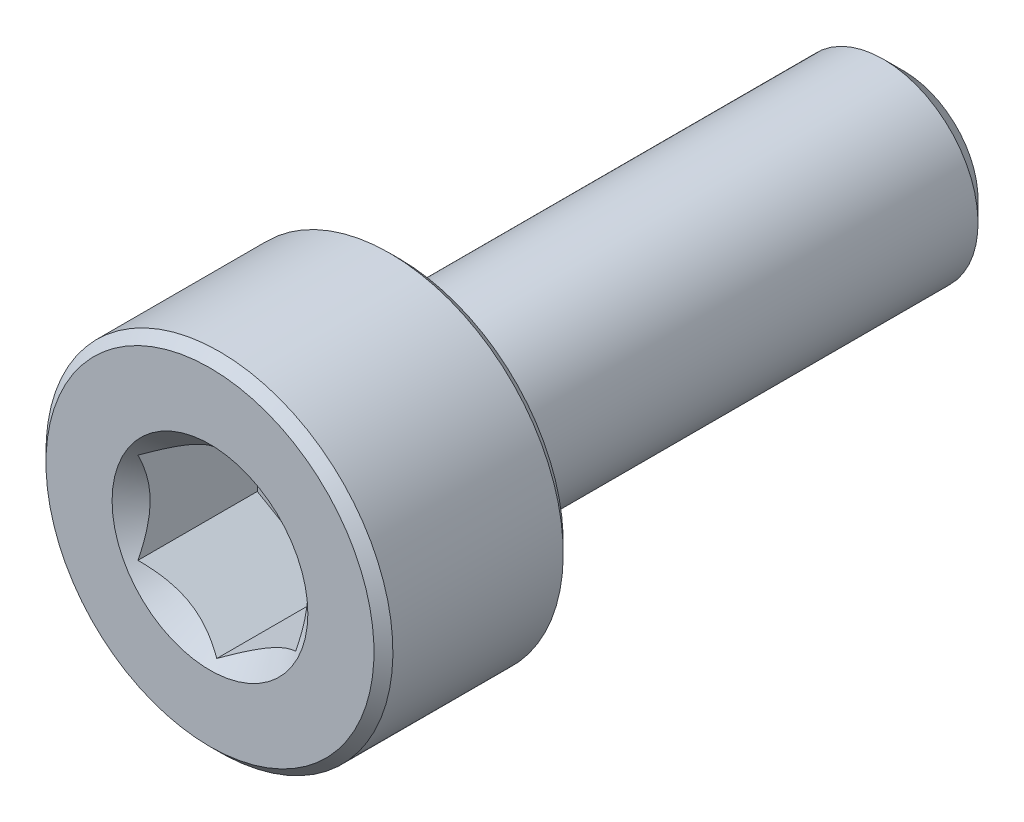
ISO-10303-21;
HEADER;
FILE_DESCRIPTION(('STEP AP214'),'2;1');
FILE_NAME('part.step','',(''),(''),'','','');
FILE_SCHEMA(('AUTOMOTIVE_DESIGN { 1 0 10303 214 1 1 1 1 }'));
ENDSEC;
DATA;
#1=APPLICATION_CONTEXT('core data for automotive mechanical design processes');
#2=APPLICATION_PROTOCOL_DEFINITION('international standard','automotive_design',2000,#1);
#3=PRODUCT_CONTEXT('',#1,'mechanical');
#4=PRODUCT('Part','Part','',(#3));
#5=PRODUCT_RELATED_PRODUCT_CATEGORY('part','',(#4));
#6=PRODUCT_DEFINITION_FORMATION('','',#4);
#7=PRODUCT_DEFINITION_CONTEXT('part definition',#1,'design');
#8=PRODUCT_DEFINITION('design','',#6,#7);
#9=PRODUCT_DEFINITION_SHAPE('','',#8);
#10=(LENGTH_UNIT() NAMED_UNIT(*) SI_UNIT(.MILLI.,.METRE.));
#11=(NAMED_UNIT(*) PLANE_ANGLE_UNIT() SI_UNIT($,.RADIAN.));
#12=(NAMED_UNIT(*) SI_UNIT($,.STERADIAN.) SOLID_ANGLE_UNIT());
#13=UNCERTAINTY_MEASURE_WITH_UNIT(LENGTH_MEASURE(1.E-05),#10,'distance_accuracy_value','');
#14=(GEOMETRIC_REPRESENTATION_CONTEXT(3) GLOBAL_UNCERTAINTY_ASSIGNED_CONTEXT((#13)) GLOBAL_UNIT_ASSIGNED_CONTEXT((#10,
#11,#12)) REPRESENTATION_CONTEXT('',''));
#15=CARTESIAN_POINT('',(0.,0.,0.));
#16=DIRECTION('',(0.,0.,1.));
#17=DIRECTION('',(1.,0.,0.));
#18=AXIS2_PLACEMENT_3D('',#15,#16,#17);
#19=CARTESIAN_POINT('',(0.,1.17524047358083,-5.5));
#20=DIRECTION('',(0.,0.,-1.));
#21=DIRECTION('',(0.,1.,0.));
#22=AXIS2_PLACEMENT_3D('',#19,#20,#21);
#23=PLANE('',#22);
#24=CARTESIAN_POINT('',(0.,0.,-5.5));
#25=DIRECTION('',(0.,0.,-1.));
#26=DIRECTION('',(0.,1.,0.));
#27=AXIS2_PLACEMENT_3D('',#24,#25,#26);
#28=CIRCLE('',#27,1.17524047358083);
#29=CARTESIAN_POINT('',(0.,1.17524047358083,-5.5));
#30=VERTEX_POINT('',#29);
#31=EDGE_CURVE('E60',#30,#30,#28,.T.);
#32=ORIENTED_EDGE('',*,*,#31,.T.);
#33=EDGE_LOOP('',(#32));
#34=FACE_BOUND('',#33,.T.);
#35=ADVANCED_FACE('F47',(#34),#23,.T.);
#36=CARTESIAN_POINT('',(0.,0.,-5.5));
#37=DIRECTION('',(0.,0.,1.));
#38=DIRECTION('',(0.,-1.,0.));
#39=AXIS2_PLACEMENT_3D('',#36,#37,#38);
#40=CONICAL_SURFACE('',#39,1.17524047358083,0.785398163397448);
#41=CARTESIAN_POINT('',(0.,0.,-5.17524047358082));
#42=DIRECTION('',(0.,0.,-1.));
#43=DIRECTION('',(0.,1.,0.));
#44=AXIS2_PLACEMENT_3D('',#41,#42,#43);
#45=CIRCLE('',#44,1.5);
#46=CARTESIAN_POINT('',(0.,1.5,-5.17524047358082));
#47=VERTEX_POINT('',#46);
#48=EDGE_CURVE('E163',#47,#47,#45,.T.);
#49=ORIENTED_EDGE('',*,*,#48,.T.);
#50=EDGE_LOOP('',(#49));
#51=FACE_BOUND('',#50,.T.);
#52=ORIENTED_EDGE('',*,*,#31,.F.);
#53=EDGE_LOOP('',(#52));
#54=FACE_BOUND('',#53,.T.);
#55=ADVANCED_FACE('F169',(#51,#54),#40,.T.);
#56=CARTESIAN_POINT('',(0.,0.,-5.5));
#57=DIRECTION('',(0.,0.,-1.));
#58=DIRECTION('',(0.,1.,0.));
#59=AXIS2_PLACEMENT_3D('',#56,#57,#58);
#60=CYLINDRICAL_SURFACE('',#59,1.5);
#61=CARTESIAN_POINT('',(0.,0.,2.35));
#62=DIRECTION('',(0.,0.,-1.));
#63=DIRECTION('',(0.,1.,0.));
#64=AXIS2_PLACEMENT_3D('',#61,#62,#63);
#65=CIRCLE('',#64,1.5);
#66=CARTESIAN_POINT('',(0.,1.5,2.35));
#67=VERTEX_POINT('',#66);
#68=EDGE_CURVE('E160',#67,#67,#65,.T.);
#69=ORIENTED_EDGE('',*,*,#68,.T.);
#70=EDGE_LOOP('',(#69));
#71=FACE_BOUND('',#70,.T.);
#72=ORIENTED_EDGE('',*,*,#48,.F.);
#73=EDGE_LOOP('',(#72));
#74=FACE_BOUND('',#73,.T.);
#75=ADVANCED_FACE('F171',(#71,#74),#60,.T.);
#76=CARTESIAN_POINT('',(0.,0.,2.35));
#77=DIRECTION('',(0.,0.,-1.));
#78=DIRECTION('',(0.,1.,0.));
#79=AXIS2_PLACEMENT_3D('',#76,#77,#78);
#80=TOROIDAL_SURFACE('',#79,1.65000000000001,0.15);
#81=CARTESIAN_POINT('',(0.,0.,2.5));
#82=DIRECTION('',(0.,0.,-1.));
#83=DIRECTION('',(0.,1.,0.));
#84=AXIS2_PLACEMENT_3D('',#81,#82,#83);
#85=CIRCLE('',#84,1.65000000000001);
#86=CARTESIAN_POINT('',(0.,1.65000000000001,2.5));
#87=VERTEX_POINT('',#86);
#88=EDGE_CURVE('E157',#87,#87,#85,.T.);
#89=ORIENTED_EDGE('',*,*,#88,.T.);
#90=EDGE_LOOP('',(#89));
#91=FACE_BOUND('',#90,.T.);
#92=ORIENTED_EDGE('',*,*,#68,.F.);
#93=EDGE_LOOP('',(#92));
#94=FACE_BOUND('',#93,.T.);
#95=ADVANCED_FACE('F177',(#91,#94),#80,.F.);
#96=CARTESIAN_POINT('',(0.,2.6,2.5));
#97=DIRECTION('',(0.,0.,-1.));
#98=DIRECTION('',(0.,1.,0.));
#99=AXIS2_PLACEMENT_3D('',#96,#97,#98);
#100=PLANE('',#99);
#101=CARTESIAN_POINT('',(0.,0.,2.5));
#102=DIRECTION('',(0.,0.,-1.));
#103=DIRECTION('',(0.,1.,0.));
#104=AXIS2_PLACEMENT_3D('',#101,#102,#103);
#105=CIRCLE('',#104,2.6);
#106=CARTESIAN_POINT('',(0.,2.6,2.5));
#107=VERTEX_POINT('',#106);
#108=EDGE_CURVE('E154',#107,#107,#105,.T.);
#109=ORIENTED_EDGE('',*,*,#108,.T.);
#110=EDGE_LOOP('',(#109));
#111=FACE_BOUND('',#110,.T.);
#112=ORIENTED_EDGE('',*,*,#88,.F.);
#113=EDGE_LOOP('',(#112));
#114=FACE_BOUND('',#113,.T.);
#115=ADVANCED_FACE('F183',(#111,#114),#100,.T.);
#116=CARTESIAN_POINT('',(0.,0.,2.5));
#117=DIRECTION('',(0.,0.,1.));
#118=DIRECTION('',(0.,-1.,0.));
#119=AXIS2_PLACEMENT_3D('',#116,#117,#118);
#120=CONICAL_SURFACE('',#119,2.6,0.785398163397445);
#121=CARTESIAN_POINT('',(0.,0.,2.65));
#122=DIRECTION('',(0.,0.,-1.));
#123=DIRECTION('',(0.,1.,0.));
#124=AXIS2_PLACEMENT_3D('',#121,#122,#123);
#125=CIRCLE('',#124,2.75);
#126=CARTESIAN_POINT('',(0.,2.75,2.65));
#127=VERTEX_POINT('',#126);
#128=EDGE_CURVE('E151',#127,#127,#125,.T.);
#129=ORIENTED_EDGE('',*,*,#128,.T.);
#130=EDGE_LOOP('',(#129));
#131=FACE_BOUND('',#130,.T.);
#132=ORIENTED_EDGE('',*,*,#108,.F.);
#133=EDGE_LOOP('',(#132));
#134=FACE_BOUND('',#133,.T.);
#135=ADVANCED_FACE('F187',(#131,#134),#120,.T.);
#136=CARTESIAN_POINT('',(0.,0.,-5.5));
#137=DIRECTION('',(0.,0.,-1.));
#138=DIRECTION('',(0.,1.,0.));
#139=AXIS2_PLACEMENT_3D('',#136,#137,#138);
#140=CYLINDRICAL_SURFACE('',#139,2.75);
#141=CARTESIAN_POINT('',(0.,0.,5.35));
#142=DIRECTION('',(0.,0.,-1.));
#143=DIRECTION('',(0.,1.,0.));
#144=AXIS2_PLACEMENT_3D('',#141,#142,#143);
#145=CIRCLE('',#144,2.75);
#146=CARTESIAN_POINT('',(0.,2.75,5.35));
#147=VERTEX_POINT('',#146);
#148=EDGE_CURVE('E148',#147,#147,#145,.T.);
#149=ORIENTED_EDGE('',*,*,#148,.T.);
#150=EDGE_LOOP('',(#149));
#151=FACE_BOUND('',#150,.T.);
#152=ORIENTED_EDGE('',*,*,#128,.F.);
#153=EDGE_LOOP('',(#152));
#154=FACE_BOUND('',#153,.T.);
#155=ADVANCED_FACE('F191',(#151,#154),#140,.T.);
#156=CARTESIAN_POINT('',(0.,0.,5.35));
#157=DIRECTION('',(0.,0.,-1.));
#158=DIRECTION('',(0.,1.,0.));
#159=AXIS2_PLACEMENT_3D('',#156,#157,#158);
#160=CONICAL_SURFACE('',#159,2.75,0.785398163397445);
#161=CARTESIAN_POINT('',(0.,0.,5.5));
#162=DIRECTION('',(0.,0.,-1.));
#163=DIRECTION('',(0.,1.,0.));
#164=AXIS2_PLACEMENT_3D('',#161,#162,#163);
#165=CIRCLE('',#164,2.6);
#166=CARTESIAN_POINT('',(0.,2.6,5.5));
#167=VERTEX_POINT('',#166);
#168=EDGE_CURVE('E145',#167,#167,#165,.T.);
#169=ORIENTED_EDGE('',*,*,#168,.T.);
#170=EDGE_LOOP('',(#169));
#171=FACE_BOUND('',#170,.T.);
#172=ORIENTED_EDGE('',*,*,#148,.F.);
#173=EDGE_LOOP('',(#172));
#174=FACE_BOUND('',#173,.T.);
#175=ADVANCED_FACE('F195',(#171,#174),#160,.T.);
#176=CARTESIAN_POINT('',(0.,0.,5.5));
#177=DIRECTION('',(0.,0.,1.));
#178=DIRECTION('',(0.,-1.,0.));
#179=AXIS2_PLACEMENT_3D('',#176,#177,#178);
#180=PLANE('',#179);
#181=CARTESIAN_POINT('',(0.,0.,5.5));
#182=DIRECTION('',(0.,0.,1.));
#183=DIRECTION('',(1.,0.,0.));
#184=AXIS2_PLACEMENT_3D('',#181,#182,#183);
#185=CIRCLE('',#184,1.55162884844712);
#186=CARTESIAN_POINT('',(1.55162884844712,0.,5.5));
#187=VERTEX_POINT('',#186);
#188=EDGE_CURVE('E119',#187,#187,#185,.T.);
#189=ORIENTED_EDGE('',*,*,#188,.F.);
#190=EDGE_LOOP('',(#189));
#191=FACE_BOUND('',#190,.T.);
#192=ORIENTED_EDGE('',*,*,#168,.F.);
#193=EDGE_LOOP('',(#192));
#194=FACE_BOUND('',#193,.T.);
#195=ADVANCED_FACE('F199',(#191,#194),#180,.T.);
#196=CARTESIAN_POINT('',(0.,0.,5.5));
#197=DIRECTION('',(0.,0.,1.));
#198=DIRECTION('',(1.,0.,0.));
#199=AXIS2_PLACEMENT_3D('',#196,#197,#198);
#200=CONICAL_SURFACE('',#199,1.55162884844712,0.78539816339745);
#201=ORIENTED_EDGE('',*,*,#188,.T.);
#202=EDGE_LOOP('',(#201));
#203=FACE_BOUND('',#202,.T.);
#204=CARTESIAN_POINT('',(-0.000199999999999347,-1.4434911430279,5.39186230843608));
#205=CARTESIAN_POINT('',(0.0427751670715876,-1.41867941875065,5.36706849258205));
#206=CARTESIAN_POINT('',(0.086469004745949,-1.39345276980743,5.34373055894563));
#207=CARTESIAN_POINT('',(0.175565930841943,-1.34201263554194,5.30099882861148));
#208=CARTESIAN_POINT('',(0.220977498357065,-1.31579425481276,5.28162881688736));
#209=CARTESIAN_POINT('',(0.31254782093526,-1.26292610442246,5.24844730794042));
#210=CARTESIAN_POINT('',(0.358683240175886,-1.23628980770471,5.2345523835796));
#211=CARTESIAN_POINT('',(0.451970080407593,-1.18243062538508,5.21314410668758));
#212=CARTESIAN_POINT('',(0.499118649136381,-1.15520938653761,5.20561476609373));
#213=CARTESIAN_POINT('',(0.580373556887253,-1.10829684367467,5.19882132257765));
#214=CARTESIAN_POINT('',(0.614374876627942,-1.08866617256958,5.19781538363129));
#215=CARTESIAN_POINT('',(0.682317764432479,-1.04943932800611,5.19950823943826));
#216=CARTESIAN_POINT('',(0.716259317655659,-1.02984316311599,5.20220785174248));
#217=CARTESIAN_POINT('',(0.783814856457501,-0.990839954603499,5.21115575484332));
#218=CARTESIAN_POINT('',(0.817428507286776,-0.971433104248771,5.21740735042665));
#219=CARTESIAN_POINT('',(0.884094638217814,-0.932943395609905,5.23312250594085));
#220=CARTESIAN_POINT('',(0.917146871030297,-0.9138606800983,5.2425874446144));
#221=CARTESIAN_POINT('',(1.00179969160027,-0.864986351354567,5.27067821521453));
#222=CARTESIAN_POINT('',(1.05286649242964,-0.835502920149076,5.29141698197914));
#223=CARTESIAN_POINT('',(1.15300085411326,-0.777690319475908,5.33813395919842));
#224=CARTESIAN_POINT('',(1.20207431157827,-0.749357745598417,5.36409512047371));
#225=CARTESIAN_POINT('',(1.2502,-0.721572366433194,5.39186230843608));
#226=B_SPLINE_CURVE_WITH_KNOTS('',3,(#204,#205,#206,#207,#208,#209,#210,#211,#212,#213,#214,
#215,#216,#217,#218,#219,#220,#221,#222,#223,#224,#225),.UNSPECIFIED.,.F.,.F.,(4,2,2,2,2,2,2,2,
2,2,4),(0.,0.166533409618304,0.334037607289762,0.498880396489698,0.663307919240275,
0.780963963458827,0.898645970148454,1.01643764860773,1.1342799317155,1.32148652032141,
1.50809158792573),.UNSPECIFIED.);
#227=CARTESIAN_POINT('',(0.,-1.44337567297406,5.39174682452694));
#228=VERTEX_POINT('',#227);
#229=CARTESIAN_POINT('',(1.25,-0.721687836487032,5.39174682452694));
#230=VERTEX_POINT('',#229);
#231=EDGE_CURVE('E12',#228,#230,#226,.T.);
#232=ORIENTED_EDGE('',*,*,#231,.F.);
#233=CARTESIAN_POINT('',(-1.2502,-0.721572366433195,5.39186230843608));
#234=CARTESIAN_POINT('',(-1.20722483292841,-0.746384090710444,5.36706849258204));
#235=CARTESIAN_POINT('',(-1.16353099525405,-0.771610739653664,5.34373055894562));
#236=CARTESIAN_POINT('',(-1.07443406915806,-0.823050873919155,5.30099882861148));
#237=CARTESIAN_POINT('',(-1.02902250164294,-0.849269254648333,5.28162881688736));
#238=CARTESIAN_POINT('',(-0.93745217906474,-0.902137405038636,5.24844730794042));
#239=CARTESIAN_POINT('',(-0.891316759824114,-0.928773701756387,5.2345523835796));
#240=CARTESIAN_POINT('',(-0.798029919592407,-0.982632884076012,5.21314410668758));
#241=CARTESIAN_POINT('',(-0.75088135086362,-1.00985412292348,5.20561476609373));
#242=CARTESIAN_POINT('',(-0.669626443112748,-1.05676666578643,5.19882132257764));
#243=CARTESIAN_POINT('',(-0.635625123372059,-1.07639733689152,5.19781538363129));
#244=CARTESIAN_POINT('',(-0.567682235567523,-1.11562418145499,5.19950823943826));
#245=CARTESIAN_POINT('',(-0.533740682344343,-1.1352203463451,5.20220785174248));
#246=CARTESIAN_POINT('',(-0.466185143542501,-1.1742235548576,5.21115575484332));
#247=CARTESIAN_POINT('',(-0.432571492713225,-1.19363040521233,5.21740735042665));
#248=CARTESIAN_POINT('',(-0.365905361782187,-1.23212011385119,5.23312250594085));
#249=CARTESIAN_POINT('',(-0.332853128969705,-1.2512028293628,5.2425874446144));
#250=CARTESIAN_POINT('',(-0.248200308399736,-1.30007715810653,5.27067821521453));
#251=CARTESIAN_POINT('',(-0.197133507570361,-1.32956058931202,5.29141698197914));
#252=CARTESIAN_POINT('',(-0.0969991458867445,-1.38737318998519,5.33813395919842));
#253=CARTESIAN_POINT('',(-0.0479256884217297,-1.41570576386268,5.36409512047371));
#254=CARTESIAN_POINT('',(0.000200000000000594,-1.4434911430279,5.39186230843608));
#255=B_SPLINE_CURVE_WITH_KNOTS('',3,(#233,#234,#235,#236,#237,#238,#239,#240,#241,#242,#243,
#244,#245,#246,#247,#248,#249,#250,#251,#252,#253,#254),.UNSPECIFIED.,.F.,.F.,(4,2,2,2,2,2,2,2,
2,2,4),(0.,0.166533409618303,0.334037607289762,0.498880396489698,0.663307919240274,
0.780963963458826,0.898645970148452,1.01643764860773,1.13427993171549,1.32148652032141,
1.50809158792574),.UNSPECIFIED.);
#256=CARTESIAN_POINT('',(-1.25,-0.721687836487032,5.39174682452694));
#257=VERTEX_POINT('',#256);
#258=EDGE_CURVE('E105',#257,#228,#255,.T.);
#259=ORIENTED_EDGE('',*,*,#258,.F.);
#260=CARTESIAN_POINT('',(-1.25,-1.52022146239345,5.91651070319084));
#261=CARTESIAN_POINT('',(-1.25,-1.48354689134962,5.88818689718723));
#262=CARTESIAN_POINT('',(-1.25,-1.44667707589305,5.86011672093046));
#263=CARTESIAN_POINT('',(-1.25,-1.37246477804769,5.80459065501776));
#264=CARTESIAN_POINT('',(-1.25,-1.33512218721453,5.77713491044787));
#265=CARTESIAN_POINT('',(-1.25,-1.22171630832114,5.69545809771049));
#266=CARTESIAN_POINT('',(-1.25,-1.14482995781092,5.64236142511929));
#267=CARTESIAN_POINT('',(-1.25,-0.983056768942587,5.53734973416941));
#268=CARTESIAN_POINT('',(-1.25,-0.897974111811056,5.48573326925832));
#269=CARTESIAN_POINT('',(-1.25,-0.723462355215556,5.39078355108508));
#270=CARTESIAN_POINT('',(-1.25,-0.634049271919706,5.34742232185915));
#271=CARTESIAN_POINT('',(-1.25,-0.5005887711437,5.29435177040724));
#272=CARTESIAN_POINT('',(-1.25,-0.45869172620811,5.27926501327173));
#273=CARTESIAN_POINT('',(-1.25,-0.373815329706778,5.25244749770266));
#274=CARTESIAN_POINT('',(-1.25,-0.330835910419723,5.24071694982871));
#275=CARTESIAN_POINT('',(-1.25,-0.244810833071148,5.22144313304601));
#276=CARTESIAN_POINT('',(-1.25,-0.201782707467569,5.21382289169453));
#277=CARTESIAN_POINT('',(-1.25,-0.115176247984994,5.20293190707962));
#278=CARTESIAN_POINT('',(-1.25,-0.0715980347745589,5.1996602260857));
#279=CARTESIAN_POINT('',(-1.25,0.0136806197531972,5.19775210045868));
#280=CARTESIAN_POINT('',(-1.25,0.0553765370047053,5.19891205716704));
#281=CARTESIAN_POINT('',(-1.25,0.13844909645316,5.20533266388463));
#282=CARTESIAN_POINT('',(-1.25,0.179825709781943,5.21059368038275));
#283=CARTESIAN_POINT('',(-1.25,0.262662840763599,5.22500574721217));
#284=CARTESIAN_POINT('',(-1.25,0.304111120669652,5.23422600730022));
#285=CARTESIAN_POINT('',(-1.25,0.386089884230835,5.25604235623938));
#286=CARTESIAN_POINT('',(-1.25,0.426620414510369,5.26863827317792));
#287=CARTESIAN_POINT('',(-1.25,0.550794781768362,5.3120595916479));
#288=CARTESIAN_POINT('',(-1.25,0.632755591043413,5.34768282700966));
#289=CARTESIAN_POINT('',(-1.25,0.792852508946384,5.42696814455953));
#290=CARTESIAN_POINT('',(-1.25,0.870973935410877,5.47065844211049));
#291=CARTESIAN_POINT('',(-1.25,1.02031328199646,5.56088158787621));
#292=CARTESIAN_POINT('',(-1.25,1.09168171050215,5.6071684587952));
#293=CARTESIAN_POINT('',(-1.25,1.19682802849918,5.67876149953673));
#294=CARTESIAN_POINT('',(-1.25,1.2314248214359,5.70288582787532));
#295=CARTESIAN_POINT('',(-1.25,1.30014350643268,5.75178258410313));
#296=CARTESIAN_POINT('',(-1.25,1.33426552680451,5.7765548314612));
#297=CARTESIAN_POINT('',(-1.25,1.36818950249276,5.8015960474388));
#298=B_SPLINE_CURVE_WITH_KNOTS('',3,(#260,#261,#262,#263,#264,#265,#266,#267,#268,#269,#270,
#271,#272,#273,#274,#275,#276,#277,#278,#279,#280,#281,#282,#283,#284,#285,#286,#287,#288,#289,
#290,#291,#292,#293,#294,#295,#296,#297),.UNSPECIFIED.,.F.,.F.,(4,2,2,2,2,2,2,2,2,2,2,2,2,2,2,2,
2,2,4),(0.,0.139012369615044,0.278057225136917,0.55825950405377,0.856585057342473,
1.15388088887299,1.28736138903992,1.42085026158167,1.55174393609413,1.68260937990424,
1.80753647715252,1.93247473971975,2.05969207441603,2.18690293152764,2.45422704655832,
2.72250450232039,2.97756898823762,3.10409578574714,3.23058769667827),.UNSPECIFIED.);
#299=CARTESIAN_POINT('',(-1.25,0.721687836487032,5.39174682452694));
#300=VERTEX_POINT('',#299);
#301=EDGE_CURVE('E118',#300,#257,#298,.F.);
#302=ORIENTED_EDGE('',*,*,#301,.F.);
#303=CARTESIAN_POINT('',(0.000199999999999644,1.4434911430279,5.39186230843608));
#304=CARTESIAN_POINT('',(-0.0427751670715869,1.41867941875065,5.36706849258204));
#305=CARTESIAN_POINT('',(-0.0864690047459483,1.39345276980743,5.34373055894562));
#306=CARTESIAN_POINT('',(-0.175565930841942,1.34201263554194,5.30099882861148));
#307=CARTESIAN_POINT('',(-0.220977498357064,1.31579425481276,5.28162881688736));
#308=CARTESIAN_POINT('',(-0.31254782093526,1.26292610442246,5.24844730794042));
#309=CARTESIAN_POINT('',(-0.358683240175885,1.23628980770471,5.2345523835796));
#310=CARTESIAN_POINT('',(-0.451970080407592,1.18243062538508,5.21314410668758));
#311=CARTESIAN_POINT('',(-0.499118649136379,1.15520938653761,5.20561476609373));
#312=CARTESIAN_POINT('',(-0.580373556887252,1.10829684367467,5.19882132257765));
#313=CARTESIAN_POINT('',(-0.61437487662794,1.08866617256958,5.19781538363129));
#314=CARTESIAN_POINT('',(-0.682317764432477,1.04943932800611,5.19950823943826));
#315=CARTESIAN_POINT('',(-0.716259317655657,1.02984316311599,5.20220785174248));
#316=CARTESIAN_POINT('',(-0.783814856457499,0.990839954603499,5.21115575484332));
#317=CARTESIAN_POINT('',(-0.817428507286774,0.971433104248771,5.21740735042665));
#318=CARTESIAN_POINT('',(-0.884094638217812,0.932943395609905,5.23312250594085));
#319=CARTESIAN_POINT('',(-0.917146871030295,0.913860680098301,5.2425874446144));
#320=CARTESIAN_POINT('',(-1.00179969160026,0.864986351354568,5.27067821521453));
#321=CARTESIAN_POINT('',(-1.05286649242964,0.835502920149076,5.29141698197914));
#322=CARTESIAN_POINT('',(-1.15300085411325,0.777690319475908,5.33813395919842));
#323=CARTESIAN_POINT('',(-1.20207431157827,0.749357745598416,5.36409512047371));
#324=CARTESIAN_POINT('',(-1.2502,0.721572366433194,5.39186230843608));
#325=B_SPLINE_CURVE_WITH_KNOTS('',3,(#303,#304,#305,#306,#307,#308,#309,#310,#311,#312,#313,
#314,#315,#316,#317,#318,#319,#320,#321,#322,#323,#324),.UNSPECIFIED.,.F.,.F.,(4,2,2,2,2,2,2,2,
2,2,4),(0.,0.166533409618304,0.334037607289761,0.498880396489698,0.663307919240274,
0.780963963458826,0.898645970148452,1.01643764860773,1.13427993171549,1.32148652032141,
1.50809158792573),.UNSPECIFIED.);
#326=CARTESIAN_POINT('',(0.,1.44337567297406,5.39174682452694));
#327=VERTEX_POINT('',#326);
#328=EDGE_CURVE('E249',#327,#300,#325,.T.);
#329=ORIENTED_EDGE('',*,*,#328,.F.);
#330=CARTESIAN_POINT('',(1.2502,0.721572366433194,5.39186230843608));
#331=CARTESIAN_POINT('',(1.20722483292841,0.746384090710444,5.36706849258205));
#332=CARTESIAN_POINT('',(1.16353099525405,0.771610739653664,5.34373055894562));
#333=CARTESIAN_POINT('',(1.07443406915806,0.823050873919154,5.30099882861148));
#334=CARTESIAN_POINT('',(1.02902250164294,0.849269254648333,5.28162881688736));
#335=CARTESIAN_POINT('',(0.93745217906474,0.902137405038635,5.24844730794042));
#336=CARTESIAN_POINT('',(0.891316759824114,0.928773701756387,5.2345523835796));
#337=CARTESIAN_POINT('',(0.798029919592408,0.982632884076012,5.21314410668758));
#338=CARTESIAN_POINT('',(0.75088135086362,1.00985412292348,5.20561476609373));
#339=CARTESIAN_POINT('',(0.669626443112748,1.05676666578643,5.19882132257764));
#340=CARTESIAN_POINT('',(0.635625123372059,1.07639733689152,5.19781538363129));
#341=CARTESIAN_POINT('',(0.567682235567523,1.11562418145499,5.19950823943826));
#342=CARTESIAN_POINT('',(0.533740682344343,1.1352203463451,5.20220785174248));
#343=CARTESIAN_POINT('',(0.466185143542501,1.1742235548576,5.21115575484332));
#344=CARTESIAN_POINT('',(0.432571492713225,1.19363040521233,5.21740735042665));
#345=CARTESIAN_POINT('',(0.365905361782187,1.23212011385119,5.23312250594085));
#346=CARTESIAN_POINT('',(0.332853128969705,1.2512028293628,5.2425874446144));
#347=CARTESIAN_POINT('',(0.248200308399736,1.30007715810653,5.27067821521453));
#348=CARTESIAN_POINT('',(0.197133507570362,1.32956058931202,5.29141698197914));
#349=CARTESIAN_POINT('',(0.0969991458867451,1.38737318998519,5.33813395919842));
#350=CARTESIAN_POINT('',(0.0479256884217304,1.41570576386268,5.36409512047371));
#351=CARTESIAN_POINT('',(-0.000200000000000344,1.4434911430279,5.39186230843608));
#352=B_SPLINE_CURVE_WITH_KNOTS('',3,(#330,#331,#332,#333,#334,#335,#336,#337,#338,#339,#340,
#341,#342,#343,#344,#345,#346,#347,#348,#349,#350,#351),.UNSPECIFIED.,.F.,.F.,(4,2,2,2,2,2,2,2,
2,2,4),(0.,0.166533409618303,0.334037607289761,0.498880396489698,0.663307919240274,
0.780963963458826,0.898645970148452,1.01643764860773,1.13427993171549,1.32148652032141,
1.50809158792574),.UNSPECIFIED.);
#353=CARTESIAN_POINT('',(1.25,0.721687836487032,5.39174682452694));
#354=VERTEX_POINT('',#353);
#355=EDGE_CURVE('E222',#354,#327,#352,.T.);
#356=ORIENTED_EDGE('',*,*,#355,.F.);
#357=CARTESIAN_POINT('',(1.25,-1.52022146239345,5.91651070319084));
#358=CARTESIAN_POINT('',(1.25,-1.48354689134962,5.88818689718723));
#359=CARTESIAN_POINT('',(1.25,-1.44667707589305,5.86011672093046));
#360=CARTESIAN_POINT('',(1.25,-1.37246477804769,5.80459065501776));
#361=CARTESIAN_POINT('',(1.25,-1.33512218721453,5.77713491044787));
#362=CARTESIAN_POINT('',(1.25,-1.22171630832114,5.69545809771049));
#363=CARTESIAN_POINT('',(1.25,-1.14482995781092,5.64236142511929));
#364=CARTESIAN_POINT('',(1.25,-0.983056768942586,5.53734973416941));
#365=CARTESIAN_POINT('',(1.25,-0.897974111811056,5.48573326925832));
#366=CARTESIAN_POINT('',(1.25,-0.723462355215555,5.39078355108508));
#367=CARTESIAN_POINT('',(1.25,-0.634049271919705,5.34742232185916));
#368=CARTESIAN_POINT('',(1.25,-0.500588771143699,5.29435177040724));
#369=CARTESIAN_POINT('',(1.25,-0.45869172620811,5.27926501327173));
#370=CARTESIAN_POINT('',(1.25,-0.373815329706778,5.25244749770266));
#371=CARTESIAN_POINT('',(1.25,-0.330835910419723,5.24071694982871));
#372=CARTESIAN_POINT('',(1.25,-0.244810833071148,5.22144313304601));
#373=CARTESIAN_POINT('',(1.25,-0.20178270746757,5.21382289169453));
#374=CARTESIAN_POINT('',(1.25,-0.115176247984995,5.20293190707962));
#375=CARTESIAN_POINT('',(1.25,-0.0715980347745595,5.1996602260857));
#376=CARTESIAN_POINT('',(1.25,0.0136806197531967,5.19775210045869));
#377=CARTESIAN_POINT('',(1.25,0.0553765370047049,5.19891205716704));
#378=CARTESIAN_POINT('',(1.25,0.13844909645316,5.20533266388463));
#379=CARTESIAN_POINT('',(1.25,0.179825709781942,5.21059368038275));
#380=CARTESIAN_POINT('',(1.25,0.262662840763599,5.22500574721217));
#381=CARTESIAN_POINT('',(1.25,0.304111120669651,5.23422600730022));
#382=CARTESIAN_POINT('',(1.25,0.386089884230835,5.25604235623938));
#383=CARTESIAN_POINT('',(1.25,0.426620414510369,5.26863827317792));
#384=CARTESIAN_POINT('',(1.25,0.550794781768362,5.3120595916479));
#385=CARTESIAN_POINT('',(1.25,0.632755591043412,5.34768282700966));
#386=CARTESIAN_POINT('',(1.25,0.792852508946383,5.42696814455953));
#387=CARTESIAN_POINT('',(1.25,0.870973935410877,5.47065844211049));
#388=CARTESIAN_POINT('',(1.25,1.02031328199646,5.56088158787621));
#389=CARTESIAN_POINT('',(1.25,1.09168171050215,5.6071684587952));
#390=CARTESIAN_POINT('',(1.25,1.19682802849918,5.67876149953673));
#391=CARTESIAN_POINT('',(1.25,1.2314248214359,5.70288582787532));
#392=CARTESIAN_POINT('',(1.25,1.30014350643268,5.75178258410313));
#393=CARTESIAN_POINT('',(1.25,1.33426552680451,5.7765548314612));
#394=CARTESIAN_POINT('',(1.25,1.36818950249276,5.8015960474388));
#395=B_SPLINE_CURVE_WITH_KNOTS('',3,(#357,#358,#359,#360,#361,#362,#363,#364,#365,#366,#367,
#368,#369,#370,#371,#372,#373,#374,#375,#376,#377,#378,#379,#380,#381,#382,#383,#384,#385,#386,
#387,#388,#389,#390,#391,#392,#393,#394),.UNSPECIFIED.,.F.,.F.,(4,2,2,2,2,2,2,2,2,2,2,2,2,2,2,2,
2,2,4),(0.,0.139012369615044,0.278057225136918,0.558259504053771,0.856585057342474,
1.15388088887299,1.28736138903992,1.42085026158167,1.55174393609413,1.68260937990424,
1.80753647715252,1.93247473971975,2.05969207441603,2.18690293152764,2.45422704655832,
2.72250450232039,2.97756898823762,3.10409578574714,3.23058769667827),.UNSPECIFIED.);
#396=EDGE_CURVE('E67',#230,#354,#395,.T.);
#397=ORIENTED_EDGE('',*,*,#396,.F.);
#398=EDGE_LOOP('',(#232,#259,#302,#329,#356,#397));
#399=FACE_BOUND('',#398,.T.);
#400=ADVANCED_FACE('F104',(#203,#399),#200,.F.);
#401=CARTESIAN_POINT('',(0.,2.6,3.5));
#402=DIRECTION('',(0.,0.,-1.));
#403=DIRECTION('',(0.,1.,0.));
#404=AXIS2_PLACEMENT_3D('',#401,#402,#403);
#405=PLANE('',#404);
#406=DIRECTION('',(0.866025403784438,0.5,0.));
#407=VECTOR('',#406,1.);
#408=CARTESIAN_POINT('',(0.,-1.44337567297406,3.5));
#409=LINE('',#408,#407);
#410=CARTESIAN_POINT('',(0.,-1.44337567297406,3.5));
#411=VERTEX_POINT('',#410);
#412=CARTESIAN_POINT('',(1.25,-0.721687836487032,3.5));
#413=VERTEX_POINT('',#412);
#414=EDGE_CURVE('E122',#411,#413,#409,.T.);
#415=ORIENTED_EDGE('',*,*,#414,.T.);
#416=DIRECTION('',(0.,1.,0.));
#417=VECTOR('',#416,1.);
#418=CARTESIAN_POINT('',(1.25,-0.721687836487032,3.5));
#419=LINE('',#418,#417);
#420=CARTESIAN_POINT('',(1.25,0.721687836487032,3.5));
#421=VERTEX_POINT('',#420);
#422=EDGE_CURVE('E74',#413,#421,#419,.T.);
#423=ORIENTED_EDGE('',*,*,#422,.T.);
#424=DIRECTION('',(-0.866025403784439,0.5,0.));
#425=VECTOR('',#424,1.);
#426=CARTESIAN_POINT('',(1.25,0.721687836487032,3.5));
#427=LINE('',#426,#425);
#428=CARTESIAN_POINT('',(0.,1.44337567297406,3.5));
#429=VERTEX_POINT('',#428);
#430=EDGE_CURVE('E130',#421,#429,#427,.T.);
#431=ORIENTED_EDGE('',*,*,#430,.T.);
#432=DIRECTION('',(-0.866025403784439,-0.5,0.));
#433=VECTOR('',#432,1.);
#434=CARTESIAN_POINT('',(0.,1.44337567297406,3.5));
#435=LINE('',#434,#433);
#436=CARTESIAN_POINT('',(-1.25,0.721687836487032,3.5));
#437=VERTEX_POINT('',#436);
#438=EDGE_CURVE('E137',#429,#437,#435,.T.);
#439=ORIENTED_EDGE('',*,*,#438,.T.);
#440=DIRECTION('',(0.,-1.,0.));
#441=VECTOR('',#440,1.);
#442=CARTESIAN_POINT('',(-1.25,0.721687836487032,3.5));
#443=LINE('',#442,#441);
#444=CARTESIAN_POINT('',(-1.25,-0.721687836487033,3.5));
#445=VERTEX_POINT('',#444);
#446=EDGE_CURVE('E133',#437,#445,#443,.T.);
#447=ORIENTED_EDGE('',*,*,#446,.T.);
#448=DIRECTION('',(0.866025403784439,-0.5,0.));
#449=VECTOR('',#448,1.);
#450=CARTESIAN_POINT('',(-1.25,-0.721687836487032,3.5));
#451=LINE('',#450,#449);
#452=EDGE_CURVE('E123',#445,#411,#451,.T.);
#453=ORIENTED_EDGE('',*,*,#452,.T.);
#454=EDGE_LOOP('',(#415,#423,#431,#439,#447,#453));
#455=FACE_BOUND('',#454,.T.);
#456=ADVANCED_FACE('F204',(#455),#405,.F.);
#457=CARTESIAN_POINT('',(0.,-1.44337567297406,-1.31881307912987));
#458=DIRECTION('',(0.5,-0.866025403784438,0.));
#459=DIRECTION('',(0.866025403784438,0.5,0.));
#460=AXIS2_PLACEMENT_3D('',#457,#458,#459);
#461=PLANE('',#460);
#462=DIRECTION('',(0.,0.,1.));
#463=VECTOR('',#462,1.);
#464=CARTESIAN_POINT('',(0.,-1.44337567297406,-1.31881307912987));
#465=LINE('',#464,#463);
#466=EDGE_CURVE('E114',#411,#228,#465,.T.);
#467=ORIENTED_EDGE('',*,*,#466,.T.);
#468=ORIENTED_EDGE('',*,*,#231,.T.);
#469=DIRECTION('',(0.,0.,1.));
#470=VECTOR('',#469,1.);
#471=CARTESIAN_POINT('',(1.25,-0.721687836487032,-1.31881307912987));
#472=LINE('',#471,#470);
#473=EDGE_CURVE('E125',#413,#230,#472,.T.);
#474=ORIENTED_EDGE('',*,*,#473,.F.);
#475=ORIENTED_EDGE('',*,*,#414,.F.);
#476=EDGE_LOOP('',(#467,#468,#474,#475));
#477=FACE_BOUND('',#476,.T.);
#478=ADVANCED_FACE('F121',(#477),#461,.F.);
#479=CARTESIAN_POINT('',(-1.25,-0.721687836487032,-1.31881307912987));
#480=DIRECTION('',(-0.5,-0.866025403784439,0.));
#481=DIRECTION('',(0.866025403784439,-0.5,0.));
#482=AXIS2_PLACEMENT_3D('',#479,#480,#481);
#483=PLANE('',#482);
#484=DIRECTION('',(0.,0.,1.));
#485=VECTOR('',#484,1.);
#486=CARTESIAN_POINT('',(-1.25,-0.721687836487032,-1.31881307912987));
#487=LINE('',#486,#485);
#488=EDGE_CURVE('E117',#445,#257,#487,.T.);
#489=ORIENTED_EDGE('',*,*,#488,.T.);
#490=ORIENTED_EDGE('',*,*,#258,.T.);
#491=ORIENTED_EDGE('',*,*,#466,.F.);
#492=ORIENTED_EDGE('',*,*,#452,.F.);
#493=EDGE_LOOP('',(#489,#490,#491,#492));
#494=FACE_BOUND('',#493,.T.);
#495=ADVANCED_FACE('F113',(#494),#483,.F.);
#496=CARTESIAN_POINT('',(-1.25,0.721687836487032,-1.31881307912987));
#497=DIRECTION('',(-1.,0.,0.));
#498=DIRECTION('',(0.,0.,1.));
#499=AXIS2_PLACEMENT_3D('',#496,#497,#498);
#500=PLANE('',#499);
#501=DIRECTION('',(0.,0.,1.));
#502=VECTOR('',#501,1.);
#503=CARTESIAN_POINT('',(-1.25,0.721687836487032,-1.31881307912987));
#504=LINE('',#503,#502);
#505=EDGE_CURVE('E134',#437,#300,#504,.T.);
#506=ORIENTED_EDGE('',*,*,#505,.T.);
#507=ORIENTED_EDGE('',*,*,#301,.T.);
#508=ORIENTED_EDGE('',*,*,#488,.F.);
#509=ORIENTED_EDGE('',*,*,#446,.F.);
#510=EDGE_LOOP('',(#506,#507,#508,#509));
#511=FACE_BOUND('',#510,.T.);
#512=ADVANCED_FACE('F258',(#511),#500,.F.);
#513=CARTESIAN_POINT('',(0.,1.44337567297406,-1.31881307912987));
#514=DIRECTION('',(-0.5,0.866025403784439,0.));
#515=DIRECTION('',(-0.866025403784439,-0.5,0.));
#516=AXIS2_PLACEMENT_3D('',#513,#514,#515);
#517=PLANE('',#516);
#518=DIRECTION('',(0.,0.,1.));
#519=VECTOR('',#518,1.);
#520=CARTESIAN_POINT('',(0.,1.44337567297406,-1.31881307912987));
#521=LINE('',#520,#519);
#522=EDGE_CURVE('E138',#429,#327,#521,.T.);
#523=ORIENTED_EDGE('',*,*,#522,.T.);
#524=ORIENTED_EDGE('',*,*,#328,.T.);
#525=ORIENTED_EDGE('',*,*,#505,.F.);
#526=ORIENTED_EDGE('',*,*,#438,.F.);
#527=EDGE_LOOP('',(#523,#524,#525,#526));
#528=FACE_BOUND('',#527,.T.);
#529=ADVANCED_FACE('F255',(#528),#517,.F.);
#530=CARTESIAN_POINT('',(1.25,0.721687836487032,-1.31881307912987));
#531=DIRECTION('',(0.5,0.866025403784439,0.));
#532=DIRECTION('',(-0.866025403784439,0.5,0.));
#533=AXIS2_PLACEMENT_3D('',#530,#531,#532);
#534=PLANE('',#533);
#535=DIRECTION('',(0.,0.,1.));
#536=VECTOR('',#535,1.);
#537=CARTESIAN_POINT('',(1.25,0.721687836487032,-1.31881307912987));
#538=LINE('',#537,#536);
#539=EDGE_CURVE('E141',#421,#354,#538,.T.);
#540=ORIENTED_EDGE('',*,*,#539,.T.);
#541=ORIENTED_EDGE('',*,*,#355,.T.);
#542=ORIENTED_EDGE('',*,*,#522,.F.);
#543=ORIENTED_EDGE('',*,*,#430,.F.);
#544=EDGE_LOOP('',(#540,#541,#542,#543));
#545=FACE_BOUND('',#544,.T.);
#546=ADVANCED_FACE('F212',(#545),#534,.F.);
#547=CARTESIAN_POINT('',(1.25,-0.721687836487032,-1.31881307912987));
#548=DIRECTION('',(1.,0.,0.));
#549=DIRECTION('',(0.,0.,-1.));
#550=AXIS2_PLACEMENT_3D('',#547,#548,#549);
#551=PLANE('',#550);
#552=ORIENTED_EDGE('',*,*,#473,.T.);
#553=ORIENTED_EDGE('',*,*,#396,.T.);
#554=ORIENTED_EDGE('',*,*,#539,.F.);
#555=ORIENTED_EDGE('',*,*,#422,.F.);
#556=EDGE_LOOP('',(#552,#553,#554,#555));
#557=FACE_BOUND('',#556,.T.);
#558=ADVANCED_FACE('F208',(#557),#551,.F.);
#559=CLOSED_SHELL('',(#35,#55,#75,#95,#115,#135,#155,#175,#195,#400,#456,#478,#495,#512,#529,
#546,#558));
#560=MANIFOLD_SOLID_BREP('B2',#559);
#561=ADVANCED_BREP_SHAPE_REPRESENTATION('',(#18,#560),#14);
#562=SHAPE_DEFINITION_REPRESENTATION(#9,#561);
ENDSEC;
END-ISO-10303-21;
